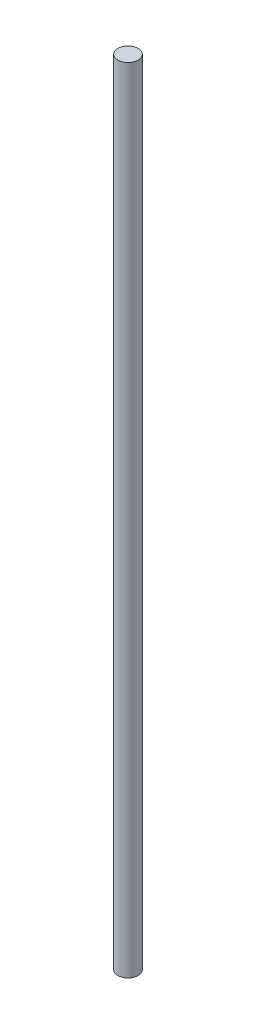
ISO-10303-21;
HEADER;
FILE_DESCRIPTION(('STEP AP214'),'2;1');
FILE_NAME('part.step','',(''),(''),'','','');
FILE_SCHEMA(('AUTOMOTIVE_DESIGN { 1 0 10303 214 1 1 1 1 }'));
ENDSEC;
DATA;
#1=APPLICATION_CONTEXT('core data for automotive mechanical design processes');
#2=APPLICATION_PROTOCOL_DEFINITION('international standard','automotive_design',2000,#1);
#3=PRODUCT_CONTEXT('',#1,'mechanical');
#4=PRODUCT('Part','Part','',(#3));
#5=PRODUCT_RELATED_PRODUCT_CATEGORY('part','',(#4));
#6=PRODUCT_DEFINITION_FORMATION('','',#4);
#7=PRODUCT_DEFINITION_CONTEXT('part definition',#1,'design');
#8=PRODUCT_DEFINITION('design','',#6,#7);
#9=PRODUCT_DEFINITION_SHAPE('','',#8);
#10=(LENGTH_UNIT() NAMED_UNIT(*) SI_UNIT(.MILLI.,.METRE.));
#11=(NAMED_UNIT(*) PLANE_ANGLE_UNIT() SI_UNIT($,.RADIAN.));
#12=(NAMED_UNIT(*) SI_UNIT($,.STERADIAN.) SOLID_ANGLE_UNIT());
#13=UNCERTAINTY_MEASURE_WITH_UNIT(LENGTH_MEASURE(1.E-05),#10,'distance_accuracy_value','');
#14=(GEOMETRIC_REPRESENTATION_CONTEXT(3) GLOBAL_UNCERTAINTY_ASSIGNED_CONTEXT((#13)) GLOBAL_UNIT_ASSIGNED_CONTEXT((#10,
#11,#12)) REPRESENTATION_CONTEXT('',''));
#15=CARTESIAN_POINT('',(0.,0.,0.));
#16=DIRECTION('',(0.,0.,1.));
#17=DIRECTION('',(1.,0.,0.));
#18=AXIS2_PLACEMENT_3D('',#15,#16,#17);
#19=CARTESIAN_POINT('',(0.,235.,0.));
#20=DIRECTION('',(0.,-1.,0.));
#21=DIRECTION('',(0.,0.,-1.));
#22=AXIS2_PLACEMENT_3D('',#19,#20,#21);
#23=CYLINDRICAL_SURFACE('',#22,3.);
#24=CARTESIAN_POINT('',(0.,235.,0.));
#25=DIRECTION('',(0.,1.,0.));
#26=DIRECTION('',(0.,0.,1.));
#27=AXIS2_PLACEMENT_3D('',#24,#25,#26);
#28=CIRCLE('',#27,3.);
#29=CARTESIAN_POINT('',(0.,235.,3.));
#30=VERTEX_POINT('',#29);
#31=EDGE_CURVE('E10',#30,#30,#28,.T.);
#32=ORIENTED_EDGE('',*,*,#31,.F.);
#33=EDGE_LOOP('',(#32));
#34=FACE_BOUND('',#33,.T.);
#35=CARTESIAN_POINT('',(0.,0.,0.));
#36=DIRECTION('',(0.,1.,0.));
#37=DIRECTION('',(0.,0.,1.));
#38=AXIS2_PLACEMENT_3D('',#35,#36,#37);
#39=CIRCLE('',#38,3.);
#40=CARTESIAN_POINT('',(0.,0.,3.));
#41=VERTEX_POINT('',#40);
#42=EDGE_CURVE('E40',#41,#41,#39,.T.);
#43=ORIENTED_EDGE('',*,*,#42,.T.);
#44=EDGE_LOOP('',(#43));
#45=FACE_BOUND('',#44,.T.);
#46=ADVANCED_FACE('F37',(#34,#45),#23,.T.);
#47=CARTESIAN_POINT('',(0.,235.,0.));
#48=DIRECTION('',(0.,1.,0.));
#49=DIRECTION('',(0.,0.,1.));
#50=AXIS2_PLACEMENT_3D('',#47,#48,#49);
#51=PLANE('',#50);
#52=ORIENTED_EDGE('',*,*,#31,.T.);
#53=EDGE_LOOP('',(#52));
#54=FACE_BOUND('',#53,.T.);
#55=ADVANCED_FACE('F52',(#54),#51,.T.);
#56=CARTESIAN_POINT('',(0.,0.,0.));
#57=DIRECTION('',(0.,1.,0.));
#58=DIRECTION('',(0.,0.,1.));
#59=AXIS2_PLACEMENT_3D('',#56,#57,#58);
#60=PLANE('',#59);
#61=ORIENTED_EDGE('',*,*,#42,.F.);
#62=EDGE_LOOP('',(#61));
#63=FACE_BOUND('',#62,.T.);
#64=ADVANCED_FACE('F50',(#63),#60,.F.);
#65=CLOSED_SHELL('',(#46,#55,#64));
#66=MANIFOLD_SOLID_BREP('B2',#65);
#67=ADVANCED_BREP_SHAPE_REPRESENTATION('',(#18,#66),#14);
#68=SHAPE_DEFINITION_REPRESENTATION(#9,#67);
ENDSEC;
END-ISO-10303-21;
